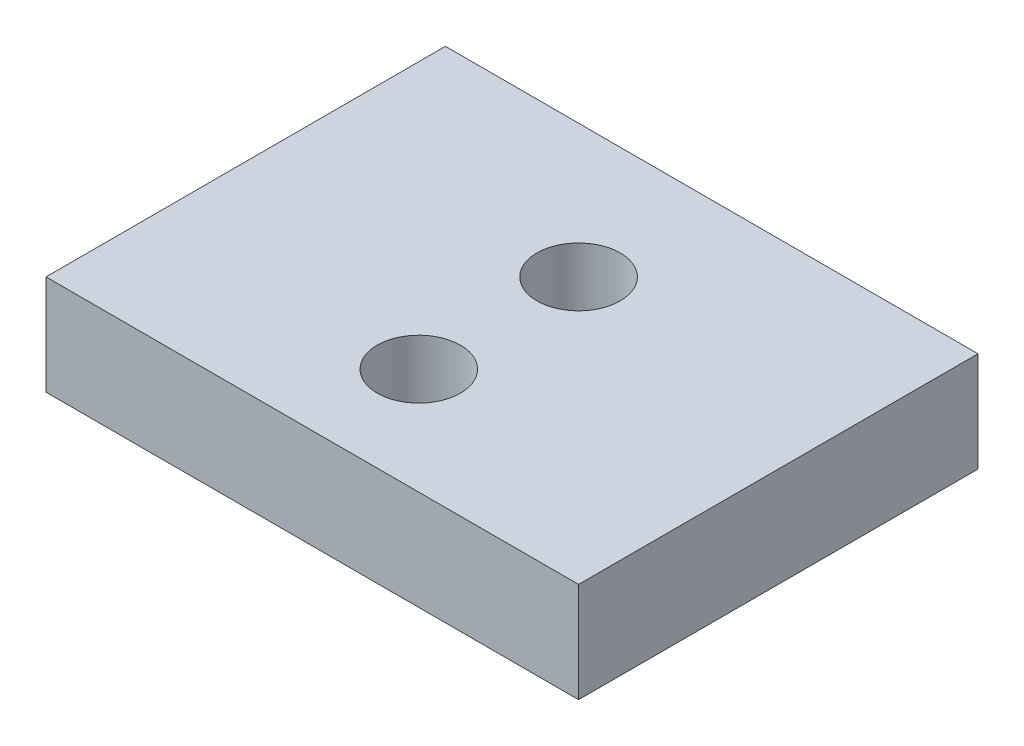
ISO-10303-21;
HEADER;
FILE_DESCRIPTION(('STEP AP214'),'2;1');
FILE_NAME('part.step','',(''),(''),'','','');
FILE_SCHEMA(('AUTOMOTIVE_DESIGN { 1 0 10303 214 1 1 1 1 }'));
ENDSEC;
DATA;
#1=APPLICATION_CONTEXT('core data for automotive mechanical design processes');
#2=APPLICATION_PROTOCOL_DEFINITION('international standard','automotive_design',2000,#1);
#3=PRODUCT_CONTEXT('',#1,'mechanical');
#4=PRODUCT('Part','Part','',(#3));
#5=PRODUCT_RELATED_PRODUCT_CATEGORY('part','',(#4));
#6=PRODUCT_DEFINITION_FORMATION('','',#4);
#7=PRODUCT_DEFINITION_CONTEXT('part definition',#1,'design');
#8=PRODUCT_DEFINITION('design','',#6,#7);
#9=PRODUCT_DEFINITION_SHAPE('','',#8);
#10=(LENGTH_UNIT() NAMED_UNIT(*) SI_UNIT(.MILLI.,.METRE.));
#11=(NAMED_UNIT(*) PLANE_ANGLE_UNIT() SI_UNIT($,.RADIAN.));
#12=(NAMED_UNIT(*) SI_UNIT($,.STERADIAN.) SOLID_ANGLE_UNIT());
#13=UNCERTAINTY_MEASURE_WITH_UNIT(LENGTH_MEASURE(1.E-05),#10,'distance_accuracy_value','');
#14=(GEOMETRIC_REPRESENTATION_CONTEXT(3) GLOBAL_UNCERTAINTY_ASSIGNED_CONTEXT((#13)) GLOBAL_UNIT_ASSIGNED_CONTEXT((#10,
#11,#12)) REPRESENTATION_CONTEXT('',''));
#15=CARTESIAN_POINT('',(0.,0.,0.));
#16=DIRECTION('',(0.,0.,1.));
#17=DIRECTION('',(1.,0.,0.));
#18=AXIS2_PLACEMENT_3D('',#15,#16,#17);
#19=CARTESIAN_POINT('',(25.4,-4.7625,38.1));
#20=DIRECTION('',(-1.,0.,0.));
#21=DIRECTION('',(0.,0.,1.));
#22=AXIS2_PLACEMENT_3D('',#19,#20,#21);
#23=PLANE('',#22);
#24=DIRECTION('',(0.,1.,0.));
#25=VECTOR('',#24,1.);
#26=CARTESIAN_POINT('',(25.4,-4.7625,0.));
#27=LINE('',#26,#25);
#28=CARTESIAN_POINT('',(25.4,-4.7625,0.));
#29=VERTEX_POINT('',#28);
#30=CARTESIAN_POINT('',(25.4,4.7625,0.));
#31=VERTEX_POINT('',#30);
#32=EDGE_CURVE('E120',#29,#31,#27,.T.);
#33=ORIENTED_EDGE('',*,*,#32,.T.);
#34=DIRECTION('',(0.,0.,-1.));
#35=VECTOR('',#34,1.);
#36=CARTESIAN_POINT('',(25.4,4.7625,38.1));
#37=LINE('',#36,#35);
#38=CARTESIAN_POINT('',(25.4,4.7625,38.1));
#39=VERTEX_POINT('',#38);
#40=EDGE_CURVE('E11',#39,#31,#37,.T.);
#41=ORIENTED_EDGE('',*,*,#40,.F.);
#42=DIRECTION('',(0.,1.,0.));
#43=VECTOR('',#42,1.);
#44=CARTESIAN_POINT('',(25.4,-4.7625,38.1));
#45=LINE('',#44,#43);
#46=CARTESIAN_POINT('',(25.4,-4.7625,38.1));
#47=VERTEX_POINT('',#46);
#48=EDGE_CURVE('E121',#47,#39,#45,.T.);
#49=ORIENTED_EDGE('',*,*,#48,.F.);
#50=DIRECTION('',(0.,0.,-1.));
#51=VECTOR('',#50,1.);
#52=CARTESIAN_POINT('',(25.4,-4.7625,38.1));
#53=LINE('',#52,#51);
#54=EDGE_CURVE('E53',#47,#29,#53,.T.);
#55=ORIENTED_EDGE('',*,*,#54,.T.);
#56=EDGE_LOOP('',(#33,#41,#49,#55));
#57=FACE_BOUND('',#56,.T.);
#58=ADVANCED_FACE('F37',(#57),#23,.F.);
#59=CARTESIAN_POINT('',(25.4,4.7625,38.1));
#60=DIRECTION('',(0.,-1.,0.));
#61=DIRECTION('',(0.,0.,-1.));
#62=AXIS2_PLACEMENT_3D('',#59,#60,#61);
#63=PLANE('',#62);
#64=CARTESIAN_POINT('',(0.,4.7625,12.7));
#65=DIRECTION('',(0.,-1.,0.));
#66=DIRECTION('',(0.,0.,-1.));
#67=AXIS2_PLACEMENT_3D('',#64,#65,#66);
#68=CIRCLE('',#67,3.96875);
#69=CARTESIAN_POINT('',(0.,4.7625,8.73125));
#70=VERTEX_POINT('',#69);
#71=EDGE_CURVE('E111',#70,#70,#68,.T.);
#72=ORIENTED_EDGE('',*,*,#71,.T.);
#73=EDGE_LOOP('',(#72));
#74=FACE_BOUND('',#73,.T.);
#75=CARTESIAN_POINT('',(0.,4.7625,27.94));
#76=DIRECTION('',(0.,-1.,0.));
#77=DIRECTION('',(0.,0.,-1.));
#78=AXIS2_PLACEMENT_3D('',#75,#76,#77);
#79=CIRCLE('',#78,3.96875);
#80=CARTESIAN_POINT('',(0.,4.7625,23.97125));
#81=VERTEX_POINT('',#80);
#82=EDGE_CURVE('E117',#81,#81,#79,.T.);
#83=ORIENTED_EDGE('',*,*,#82,.T.);
#84=EDGE_LOOP('',(#83));
#85=FACE_BOUND('',#84,.T.);
#86=DIRECTION('',(-1.,0.,0.));
#87=VECTOR('',#86,1.);
#88=CARTESIAN_POINT('',(25.4,4.7625,0.));
#89=LINE('',#88,#87);
#90=CARTESIAN_POINT('',(-25.4,4.7625,0.));
#91=VERTEX_POINT('',#90);
#92=EDGE_CURVE('E131',#31,#91,#89,.T.);
#93=ORIENTED_EDGE('',*,*,#92,.T.);
#94=DIRECTION('',(0.,0.,-1.));
#95=VECTOR('',#94,1.);
#96=CARTESIAN_POINT('',(-25.4,4.7625,38.1));
#97=LINE('',#96,#95);
#98=CARTESIAN_POINT('',(-25.4,4.7625,38.1));
#99=VERTEX_POINT('',#98);
#100=EDGE_CURVE('E45',#99,#91,#97,.T.);
#101=ORIENTED_EDGE('',*,*,#100,.F.);
#102=DIRECTION('',(-1.,0.,0.));
#103=VECTOR('',#102,1.);
#104=CARTESIAN_POINT('',(25.4,4.7625,38.1));
#105=LINE('',#104,#103);
#106=EDGE_CURVE('E79',#39,#99,#105,.T.);
#107=ORIENTED_EDGE('',*,*,#106,.F.);
#108=ORIENTED_EDGE('',*,*,#40,.T.);
#109=EDGE_LOOP('',(#93,#101,#107,#108));
#110=FACE_BOUND('',#109,.T.);
#111=ADVANCED_FACE('F143',(#74,#85,#110),#63,.F.);
#112=CARTESIAN_POINT('',(-25.4,-4.7625,38.1));
#113=DIRECTION('',(-1.,0.,0.));
#114=DIRECTION('',(0.,0.,1.));
#115=AXIS2_PLACEMENT_3D('',#112,#113,#114);
#116=PLANE('',#115);
#117=DIRECTION('',(0.,1.,0.));
#118=VECTOR('',#117,1.);
#119=CARTESIAN_POINT('',(-25.4,-4.7625,0.));
#120=LINE('',#119,#118);
#121=CARTESIAN_POINT('',(-25.4,-4.7625,0.));
#122=VERTEX_POINT('',#121);
#123=EDGE_CURVE('E134',#122,#91,#120,.T.);
#124=ORIENTED_EDGE('',*,*,#123,.F.);
#125=DIRECTION('',(0.,0.,-1.));
#126=VECTOR('',#125,1.);
#127=CARTESIAN_POINT('',(-25.4,-4.7625,38.1));
#128=LINE('',#127,#126);
#129=CARTESIAN_POINT('',(-25.4,-4.7625,38.1));
#130=VERTEX_POINT('',#129);
#131=EDGE_CURVE('E68',#130,#122,#128,.T.);
#132=ORIENTED_EDGE('',*,*,#131,.F.);
#133=DIRECTION('',(0.,1.,0.));
#134=VECTOR('',#133,1.);
#135=CARTESIAN_POINT('',(-25.4,-4.7625,38.1));
#136=LINE('',#135,#134);
#137=EDGE_CURVE('E125',#130,#99,#136,.T.);
#138=ORIENTED_EDGE('',*,*,#137,.T.);
#139=ORIENTED_EDGE('',*,*,#100,.T.);
#140=EDGE_LOOP('',(#124,#132,#138,#139));
#141=FACE_BOUND('',#140,.T.);
#142=ADVANCED_FACE('F141',(#141),#116,.T.);
#143=CARTESIAN_POINT('',(25.4,-4.7625,38.1));
#144=DIRECTION('',(0.,-1.,0.));
#145=DIRECTION('',(0.,0.,-1.));
#146=AXIS2_PLACEMENT_3D('',#143,#144,#145);
#147=PLANE('',#146);
#148=CARTESIAN_POINT('',(0.,-4.7625,12.7));
#149=DIRECTION('',(0.,-1.,0.));
#150=DIRECTION('',(0.,0.,-1.));
#151=AXIS2_PLACEMENT_3D('',#148,#149,#150);
#152=CIRCLE('',#151,3.96875);
#153=CARTESIAN_POINT('',(0.,-4.7625,8.73125));
#154=VERTEX_POINT('',#153);
#155=EDGE_CURVE('E108',#154,#154,#152,.T.);
#156=ORIENTED_EDGE('',*,*,#155,.F.);
#157=EDGE_LOOP('',(#156));
#158=FACE_BOUND('',#157,.T.);
#159=CARTESIAN_POINT('',(0.,-4.7625,27.94));
#160=DIRECTION('',(0.,-1.,0.));
#161=DIRECTION('',(0.,0.,-1.));
#162=AXIS2_PLACEMENT_3D('',#159,#160,#161);
#163=CIRCLE('',#162,3.96875);
#164=CARTESIAN_POINT('',(0.,-4.7625,23.97125));
#165=VERTEX_POINT('',#164);
#166=EDGE_CURVE('E114',#165,#165,#163,.T.);
#167=ORIENTED_EDGE('',*,*,#166,.F.);
#168=EDGE_LOOP('',(#167));
#169=FACE_BOUND('',#168,.T.);
#170=DIRECTION('',(-1.,0.,0.));
#171=VECTOR('',#170,1.);
#172=CARTESIAN_POINT('',(25.4,-4.7625,0.));
#173=LINE('',#172,#171);
#174=EDGE_CURVE('E123',#29,#122,#173,.T.);
#175=ORIENTED_EDGE('',*,*,#174,.F.);
#176=ORIENTED_EDGE('',*,*,#54,.F.);
#177=DIRECTION('',(-1.,0.,0.));
#178=VECTOR('',#177,1.);
#179=CARTESIAN_POINT('',(25.4,-4.7625,38.1));
#180=LINE('',#179,#178);
#181=EDGE_CURVE('E128',#47,#130,#180,.T.);
#182=ORIENTED_EDGE('',*,*,#181,.T.);
#183=ORIENTED_EDGE('',*,*,#131,.T.);
#184=EDGE_LOOP('',(#175,#176,#182,#183));
#185=FACE_BOUND('',#184,.T.);
#186=ADVANCED_FACE('F147',(#158,#169,#185),#147,.T.);
#187=CARTESIAN_POINT('',(0.,0.,38.1));
#188=DIRECTION('',(0.,0.,1.));
#189=DIRECTION('',(1.,0.,0.));
#190=AXIS2_PLACEMENT_3D('',#187,#188,#189);
#191=PLANE('',#190);
#192=ORIENTED_EDGE('',*,*,#48,.T.);
#193=ORIENTED_EDGE('',*,*,#106,.T.);
#194=ORIENTED_EDGE('',*,*,#137,.F.);
#195=ORIENTED_EDGE('',*,*,#181,.F.);
#196=EDGE_LOOP('',(#192,#193,#194,#195));
#197=FACE_BOUND('',#196,.T.);
#198=ADVANCED_FACE('F149',(#197),#191,.T.);
#199=CARTESIAN_POINT('',(0.,0.,0.));
#200=DIRECTION('',(0.,0.,1.));
#201=DIRECTION('',(1.,0.,0.));
#202=AXIS2_PLACEMENT_3D('',#199,#200,#201);
#203=PLANE('',#202);
#204=CARTESIAN_POINT('',(12.7,0.,0.));
#205=DIRECTION('',(0.,0.,-1.));
#206=DIRECTION('',(-1.,0.,0.));
#207=AXIS2_PLACEMENT_3D('',#204,#205,#206);
#208=CIRCLE('',#207,1.72719999999999);
#209=CARTESIAN_POINT('',(10.9728,0.,0.));
#210=VERTEX_POINT('',#209);
#211=EDGE_CURVE('E98',#210,#210,#208,.T.);
#212=ORIENTED_EDGE('',*,*,#211,.F.);
#213=EDGE_LOOP('',(#212));
#214=FACE_BOUND('',#213,.T.);
#215=CARTESIAN_POINT('',(-12.7,0.,0.));
#216=DIRECTION('',(0.,0.,-1.));
#217=DIRECTION('',(-1.,0.,0.));
#218=AXIS2_PLACEMENT_3D('',#215,#216,#217);
#219=CIRCLE('',#218,1.72719999999999);
#220=CARTESIAN_POINT('',(-14.4272,0.,0.));
#221=VERTEX_POINT('',#220);
#222=EDGE_CURVE('E97',#221,#221,#219,.T.);
#223=ORIENTED_EDGE('',*,*,#222,.F.);
#224=EDGE_LOOP('',(#223));
#225=FACE_BOUND('',#224,.T.);
#226=ORIENTED_EDGE('',*,*,#32,.F.);
#227=ORIENTED_EDGE('',*,*,#174,.T.);
#228=ORIENTED_EDGE('',*,*,#123,.T.);
#229=ORIENTED_EDGE('',*,*,#92,.F.);
#230=EDGE_LOOP('',(#226,#227,#228,#229));
#231=FACE_BOUND('',#230,.T.);
#232=ADVANCED_FACE('F146',(#214,#225,#231),#203,.F.);
#233=CARTESIAN_POINT('',(0.,-4.7625,27.94));
#234=DIRECTION('',(0.,-1.,0.));
#235=DIRECTION('',(0.,0.,-1.));
#236=AXIS2_PLACEMENT_3D('',#233,#234,#235);
#237=CYLINDRICAL_SURFACE('',#236,3.96875);
#238=ORIENTED_EDGE('',*,*,#82,.F.);
#239=EDGE_LOOP('',(#238));
#240=FACE_BOUND('',#239,.T.);
#241=ORIENTED_EDGE('',*,*,#166,.T.);
#242=EDGE_LOOP('',(#241));
#243=FACE_BOUND('',#242,.T.);
#244=ADVANCED_FACE('F174',(#240,#243),#237,.F.);
#245=CARTESIAN_POINT('',(0.,-4.7625,12.7));
#246=DIRECTION('',(0.,-1.,0.));
#247=DIRECTION('',(0.,0.,-1.));
#248=AXIS2_PLACEMENT_3D('',#245,#246,#247);
#249=CYLINDRICAL_SURFACE('',#248,3.96875);
#250=ORIENTED_EDGE('',*,*,#71,.F.);
#251=EDGE_LOOP('',(#250));
#252=FACE_BOUND('',#251,.T.);
#253=ORIENTED_EDGE('',*,*,#155,.T.);
#254=EDGE_LOOP('',(#253));
#255=FACE_BOUND('',#254,.T.);
#256=ADVANCED_FACE('F177',(#252,#255),#249,.F.);
#257=CARTESIAN_POINT('',(-12.7,0.,25.4));
#258=DIRECTION('',(0.,0.,-1.));
#259=DIRECTION('',(-1.,0.,0.));
#260=AXIS2_PLACEMENT_3D('',#257,#258,#259);
#261=CONICAL_SURFACE('',#260,1.72719999999999,1.02974425867665);
#262=CARTESIAN_POINT('',(-12.7,0.,26.4378064611844));
#263=VERTEX_POINT('',#262);
#264=VERTEX_LOOP('',#263);
#265=FACE_BOUND('',#264,.T.);
#266=CARTESIAN_POINT('',(-12.7,0.,25.4));
#267=DIRECTION('',(0.,0.,-1.));
#268=DIRECTION('',(-1.,0.,0.));
#269=AXIS2_PLACEMENT_3D('',#266,#267,#268);
#270=CIRCLE('',#269,1.72719999999999);
#271=CARTESIAN_POINT('',(-14.4272,0.,25.4));
#272=VERTEX_POINT('',#271);
#273=EDGE_CURVE('E101',#272,#272,#270,.T.);
#274=ORIENTED_EDGE('',*,*,#273,.T.);
#275=EDGE_LOOP('',(#274));
#276=FACE_BOUND('',#275,.T.);
#277=ADVANCED_FACE('F184',(#265,#276),#261,.F.);
#278=CARTESIAN_POINT('',(-12.7,0.,0.));
#279=DIRECTION('',(0.,0.,-1.));
#280=DIRECTION('',(-1.,0.,0.));
#281=AXIS2_PLACEMENT_3D('',#278,#279,#280);
#282=CYLINDRICAL_SURFACE('',#281,1.72719999999999);
#283=ORIENTED_EDGE('',*,*,#273,.F.);
#284=EDGE_LOOP('',(#283));
#285=FACE_BOUND('',#284,.T.);
#286=ORIENTED_EDGE('',*,*,#222,.T.);
#287=EDGE_LOOP('',(#286));
#288=FACE_BOUND('',#287,.T.);
#289=ADVANCED_FACE('F91',(#285,#288),#282,.F.);
#290=CARTESIAN_POINT('',(12.7,0.,25.4));
#291=DIRECTION('',(0.,0.,-1.));
#292=DIRECTION('',(-1.,0.,0.));
#293=AXIS2_PLACEMENT_3D('',#290,#291,#292);
#294=CONICAL_SURFACE('',#293,1.72719999999999,1.02974425867665);
#295=CARTESIAN_POINT('',(12.7,0.,26.4378064611844));
#296=VERTEX_POINT('',#295);
#297=VERTEX_LOOP('',#296);
#298=FACE_BOUND('',#297,.T.);
#299=CARTESIAN_POINT('',(12.7,0.,25.4));
#300=DIRECTION('',(0.,0.,-1.));
#301=DIRECTION('',(-1.,0.,0.));
#302=AXIS2_PLACEMENT_3D('',#299,#300,#301);
#303=CIRCLE('',#302,1.72719999999999);
#304=CARTESIAN_POINT('',(10.9728,0.,25.4));
#305=VERTEX_POINT('',#304);
#306=EDGE_CURVE('E95',#305,#305,#303,.T.);
#307=ORIENTED_EDGE('',*,*,#306,.T.);
#308=EDGE_LOOP('',(#307));
#309=FACE_BOUND('',#308,.T.);
#310=ADVANCED_FACE('F87',(#298,#309),#294,.F.);
#311=CARTESIAN_POINT('',(12.7,0.,0.));
#312=DIRECTION('',(0.,0.,-1.));
#313=DIRECTION('',(-1.,0.,0.));
#314=AXIS2_PLACEMENT_3D('',#311,#312,#313);
#315=CYLINDRICAL_SURFACE('',#314,1.72719999999999);
#316=ORIENTED_EDGE('',*,*,#306,.F.);
#317=EDGE_LOOP('',(#316));
#318=FACE_BOUND('',#317,.T.);
#319=ORIENTED_EDGE('',*,*,#211,.T.);
#320=EDGE_LOOP('',(#319));
#321=FACE_BOUND('',#320,.T.);
#322=ADVANCED_FACE('F90',(#318,#321),#315,.F.);
#323=CLOSED_SHELL('',(#58,#111,#142,#186,#198,#232,#244,#256,#277,#289,#310,#322));
#324=MANIFOLD_SOLID_BREP('B2',#323);
#325=ADVANCED_BREP_SHAPE_REPRESENTATION('',(#18,#324),#14);
#326=SHAPE_DEFINITION_REPRESENTATION(#9,#325);
ENDSEC;
END-ISO-10303-21;
